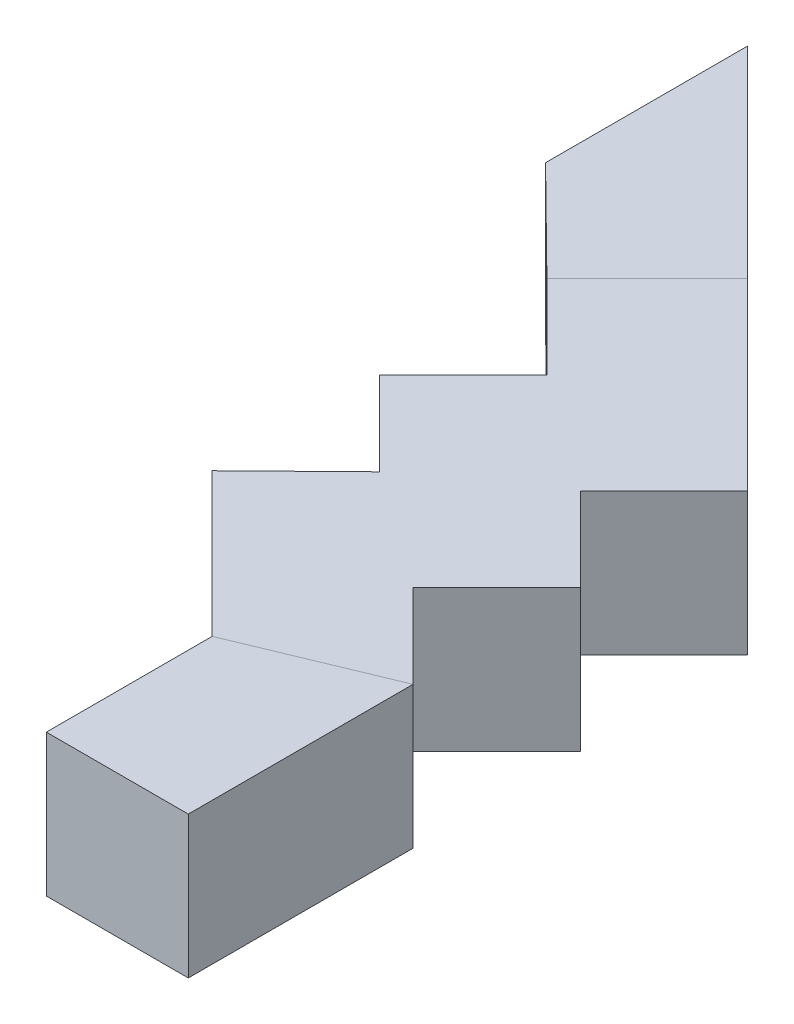
ISO-10303-21;
HEADER;
FILE_DESCRIPTION(('STEP AP214'),'2;1');
FILE_NAME('part.step','',(''),(''),'','','');
FILE_SCHEMA(('AUTOMOTIVE_DESIGN { 1 0 10303 214 1 1 1 1 }'));
ENDSEC;
DATA;
#1=APPLICATION_CONTEXT('core data for automotive mechanical design processes');
#2=APPLICATION_PROTOCOL_DEFINITION('international standard','automotive_design',2000,#1);
#3=PRODUCT_CONTEXT('',#1,'mechanical');
#4=PRODUCT('Part','Part','',(#3));
#5=PRODUCT_RELATED_PRODUCT_CATEGORY('part','',(#4));
#6=PRODUCT_DEFINITION_FORMATION('','',#4);
#7=PRODUCT_DEFINITION_CONTEXT('part definition',#1,'design');
#8=PRODUCT_DEFINITION('design','',#6,#7);
#9=PRODUCT_DEFINITION_SHAPE('','',#8);
#10=(LENGTH_UNIT() NAMED_UNIT(*) SI_UNIT(.MILLI.,.METRE.));
#11=(NAMED_UNIT(*) PLANE_ANGLE_UNIT() SI_UNIT($,.RADIAN.));
#12=(NAMED_UNIT(*) SI_UNIT($,.STERADIAN.) SOLID_ANGLE_UNIT());
#13=UNCERTAINTY_MEASURE_WITH_UNIT(LENGTH_MEASURE(1.E-05),#10,'distance_accuracy_value','');
#14=(GEOMETRIC_REPRESENTATION_CONTEXT(3) GLOBAL_UNCERTAINTY_ASSIGNED_CONTEXT((#13)) GLOBAL_UNIT_ASSIGNED_CONTEXT((#10,
#11,#12)) REPRESENTATION_CONTEXT('',''));
#15=CARTESIAN_POINT('',(0.,0.,0.));
#16=DIRECTION('',(0.,0.,1.));
#17=DIRECTION('',(1.,0.,0.));
#18=AXIS2_PLACEMENT_3D('',#15,#16,#17);
#19=CARTESIAN_POINT('',(0.,0.,0.));
#20=DIRECTION('',(0.,1.,0.));
#21=DIRECTION('',(0.,0.,1.));
#22=AXIS2_PLACEMENT_3D('',#19,#20,#21);
#23=PLANE('',#22);
#24=DIRECTION('',(-1.,0.,0.));
#25=VECTOR('',#24,1.);
#26=CARTESIAN_POINT('',(0.,0.,2800.772749124));
#27=LINE('',#26,#25);
#28=CARTESIAN_POINT('',(-7010.19169348405,0.,2800.772749124));
#29=VERTEX_POINT('',#28);
#30=CARTESIAN_POINT('',(-7610.19169348406,0.,2800.772749124));
#31=VERTEX_POINT('',#30);
#32=EDGE_CURVE('E56',#29,#31,#27,.T.);
#33=ORIENTED_EDGE('',*,*,#32,.F.);
#34=DIRECTION('',(0.,0.,-1.));
#35=VECTOR('',#34,1.);
#36=CARTESIAN_POINT('',(-7010.19169348405,0.,2800.77274912401));
#37=LINE('',#36,#35);
#38=CARTESIAN_POINT('',(-7010.19169348406,0.,1850.77274912401));
#39=VERTEX_POINT('',#38);
#40=EDGE_CURVE('E181',#29,#39,#37,.T.);
#41=ORIENTED_EDGE('',*,*,#40,.T.);
#42=DIRECTION('',(-0.923622513371796,0.,0.383303343049296));
#43=VECTOR('',#42,1.);
#44=CARTESIAN_POINT('',(-374.722918828578,0.,-902.946792358019));
#45=LINE('',#44,#43);
#46=CARTESIAN_POINT('',(-7610.19169348406,0.,2099.77274912401));
#47=VERTEX_POINT('',#46);
#48=EDGE_CURVE('E186',#39,#47,#45,.T.);
#49=ORIENTED_EDGE('',*,*,#48,.T.);
#50=DIRECTION('',(0.,0.,1.));
#51=VECTOR('',#50,1.);
#52=CARTESIAN_POINT('',(-7610.19169348406,0.,3400.77274912401));
#53=LINE('',#52,#51);
#54=EDGE_CURVE('E174',#47,#31,#53,.T.);
#55=ORIENTED_EDGE('',*,*,#54,.T.);
#56=EDGE_LOOP('',(#33,#41,#49,#55));
#57=FACE_BOUND('',#56,.T.);
#58=ADVANCED_FACE('F39',(#57),#23,.T.);
#59=CARTESIAN_POINT('',(0.,-600.,0.));
#60=DIRECTION('',(0.,1.,0.));
#61=DIRECTION('',(0.,0.,1.));
#62=AXIS2_PLACEMENT_3D('',#59,#60,#61);
#63=PLANE('',#62);
#64=DIRECTION('',(0.,0.,-1.));
#65=VECTOR('',#64,1.);
#66=CARTESIAN_POINT('',(-7010.19169348406,-600.,3400.77274912401));
#67=LINE('',#66,#65);
#68=CARTESIAN_POINT('',(-7010.19169348404,-600.,2800.772749124));
#69=VERTEX_POINT('',#68);
#70=CARTESIAN_POINT('',(-7010.19169348406,-600.,1850.77274912401));
#71=VERTEX_POINT('',#70);
#72=EDGE_CURVE('E43',#69,#71,#67,.T.);
#73=ORIENTED_EDGE('',*,*,#72,.F.);
#74=DIRECTION('',(-1.,0.,0.));
#75=VECTOR('',#74,1.);
#76=CARTESIAN_POINT('',(0.,-600.,2800.772749124));
#77=LINE('',#76,#75);
#78=CARTESIAN_POINT('',(-7610.19169348406,-600.,2800.772749124));
#79=VERTEX_POINT('',#78);
#80=EDGE_CURVE('E152',#69,#79,#77,.T.);
#81=ORIENTED_EDGE('',*,*,#80,.T.);
#82=DIRECTION('',(0.,0.,1.));
#83=VECTOR('',#82,1.);
#84=CARTESIAN_POINT('',(-7610.19169348406,-600.,3400.77274912401));
#85=LINE('',#84,#83);
#86=CARTESIAN_POINT('',(-7610.19169348406,-600.,2099.77274912401));
#87=VERTEX_POINT('',#86);
#88=EDGE_CURVE('E163',#87,#79,#85,.T.);
#89=ORIENTED_EDGE('',*,*,#88,.F.);
#90=DIRECTION('',(0.707106781186547,0.,0.707106781186548));
#91=VECTOR('',#90,1.);
#92=CARTESIAN_POINT('',(-7610.19169348406,-600.,2099.77274912401));
#93=LINE('',#92,#91);
#94=CARTESIAN_POINT('',(-8216.47211874121,-600.,1493.49232386685));
#95=VERTEX_POINT('',#94);
#96=EDGE_CURVE('E197',#95,#87,#93,.T.);
#97=ORIENTED_EDGE('',*,*,#96,.F.);
#98=DIRECTION('',(-0.714982573332399,0.,0.699142274384106));
#99=VECTOR('',#98,1.);
#100=CARTESIAN_POINT('',(-8216.47211874121,-600.,1493.49232386685));
#101=LINE('',#100,#99);
#102=CARTESIAN_POINT('',(-7858.71983090791,-600.,1143.66596793746));
#103=VERTEX_POINT('',#102);
#104=EDGE_CURVE('E236',#103,#95,#101,.T.);
#105=ORIENTED_EDGE('',*,*,#104,.F.);
#106=DIRECTION('',(0.707106781186548,0.,0.707106781186547));
#107=VECTOR('',#106,1.);
#108=CARTESIAN_POINT('',(-7858.71983090791,-600.,1143.66596793746));
#109=LINE('',#108,#107);
#110=CARTESIAN_POINT('',(-8212.27322150119,-600.,790.112577344185));
#111=VERTEX_POINT('',#110);
#112=EDGE_CURVE('E239',#111,#103,#109,.T.);
#113=ORIENTED_EDGE('',*,*,#112,.F.);
#114=DIRECTION('',(-0.707106781186546,0.,0.707106781186549));
#115=VECTOR('',#114,1.);
#116=CARTESIAN_POINT('',(-7858.71983090791,-600.,436.55918675091));
#117=LINE('',#116,#115);
#118=CARTESIAN_POINT('',(-7858.71983090791,-600.,436.55918675091));
#119=VERTEX_POINT('',#118);
#120=EDGE_CURVE('E276',#119,#111,#117,.T.);
#121=ORIENTED_EDGE('',*,*,#120,.F.);
#122=DIRECTION('',(0.707106781186548,0.,0.707106781186547));
#123=VECTOR('',#122,1.);
#124=CARTESIAN_POINT('',(-7858.71983090791,-600.,436.55918675091));
#125=LINE('',#124,#123);
#126=CARTESIAN_POINT('',(-8212.27322150119,-600.,83.0057961576385));
#127=VERTEX_POINT('',#126);
#128=EDGE_CURVE('E280',#127,#119,#125,.T.);
#129=ORIENTED_EDGE('',*,*,#128,.F.);
#130=DIRECTION('',(-0.711924819814183,0.,-0.702255687718186));
#131=VECTOR('',#130,1.);
#132=CARTESIAN_POINT('',(-4091.48873489222,-600.,4147.82312383182));
#133=LINE('',#132,#131);
#134=CARTESIAN_POINT('',(-8639.44310705767,-600.,-338.362406502111));
#135=VERTEX_POINT('',#134);
#136=EDGE_CURVE('E305',#127,#135,#133,.T.);
#137=ORIENTED_EDGE('',*,*,#136,.T.);
#138=DIRECTION('',(0.,0.,-1.));
#139=VECTOR('',#138,1.);
#140=CARTESIAN_POINT('',(-8639.44310705767,-600.,0.));
#141=LINE('',#140,#139);
#142=CARTESIAN_POINT('',(-8639.44310705767,-600.,-1192.6922268227));
#143=VERTEX_POINT('',#142);
#144=EDGE_CURVE('E299',#135,#143,#141,.T.);
#145=ORIENTED_EDGE('',*,*,#144,.T.);
#146=DIRECTION('',(-0.707106781186546,0.,-0.707106781186549));
#147=VECTOR('',#146,1.);
#148=CARTESIAN_POINT('',(-7010.19169348406,-600.,436.55918675091));
#149=LINE('',#148,#147);
#150=CARTESIAN_POINT('',(-7788.00915278926,-600.,-341.258272554294));
#151=VERTEX_POINT('',#150);
#152=EDGE_CURVE('E287',#151,#143,#149,.T.);
#153=ORIENTED_EDGE('',*,*,#152,.F.);
#154=CARTESIAN_POINT('',(-7010.19169348406,-600.,436.55918675091));
#155=VERTEX_POINT('',#154);
#156=EDGE_CURVE('E282',#155,#151,#149,.T.);
#157=ORIENTED_EDGE('',*,*,#156,.F.);
#158=DIRECTION('',(0.707106781186548,0.,-0.707106781186547));
#159=VECTOR('',#158,1.);
#160=CARTESIAN_POINT('',(-7363.74508407733,-600.,790.112577344184));
#161=LINE('',#160,#159);
#162=CARTESIAN_POINT('',(-7363.74508407733,-600.,790.112577344184));
#163=VERTEX_POINT('',#162);
#164=EDGE_CURVE('E288',#163,#155,#161,.T.);
#165=ORIENTED_EDGE('',*,*,#164,.F.);
#166=DIRECTION('',(-0.707106781186548,0.,-0.707106781186547));
#167=VECTOR('',#166,1.);
#168=CARTESIAN_POINT('',(-7010.19169348406,-600.,1143.66596793746));
#169=LINE('',#168,#167);
#170=CARTESIAN_POINT('',(-7010.19169348406,-600.,1143.66596793746));
#171=VERTEX_POINT('',#170);
#172=EDGE_CURVE('E291',#171,#163,#169,.T.);
#173=ORIENTED_EDGE('',*,*,#172,.F.);
#174=DIRECTION('',(0.707106781186547,0.,-0.707106781186548));
#175=VECTOR('',#174,1.);
#176=CARTESIAN_POINT('',(-7363.74508407733,-600.,1497.21935853073));
#177=LINE('',#176,#175);
#178=CARTESIAN_POINT('',(-7363.74508407733,-600.,1497.21935853073));
#179=VERTEX_POINT('',#178);
#180=EDGE_CURVE('E211',#179,#171,#177,.T.);
#181=ORIENTED_EDGE('',*,*,#180,.F.);
#182=DIRECTION('',(-0.707106781186548,0.,-0.707106781186547));
#183=VECTOR('',#182,1.);
#184=CARTESIAN_POINT('',(-7010.19169348406,-600.,1850.77274912401));
#185=LINE('',#184,#183);
#186=EDGE_CURVE('E208',#71,#179,#185,.T.);
#187=ORIENTED_EDGE('',*,*,#186,.F.);
#188=EDGE_LOOP('',(#73,#81,#89,#97,#105,#113,#121,#129,#137,#145,#153,#157,#165,#173,#181,#187));
#189=FACE_BOUND('',#188,.T.);
#190=ADVANCED_FACE('F161',(#189),#63,.F.);
#191=CARTESIAN_POINT('',(-7369.52720002991,-600.,77.2236802050576));
#192=DIRECTION('',(0.707106781186546,0.,-0.707106781186549));
#193=DIRECTION('',(-0.707106781186549,0.,-0.707106781186546));
#194=AXIS2_PLACEMENT_3D('',#191,#192,#193);
#195=PLANE('',#194);
#196=ORIENTED_EDGE('',*,*,#156,.T.);
#197=DIRECTION('',(0.,1.,0.));
#198=VECTOR('',#197,1.);
#199=CARTESIAN_POINT('',(-7788.00915278926,-600.,-341.258272554292));
#200=LINE('',#199,#198);
#201=CARTESIAN_POINT('',(-7788.00915278926,0.,-341.258272554292));
#202=VERTEX_POINT('',#201);
#203=EDGE_CURVE('E49',#151,#202,#200,.T.);
#204=ORIENTED_EDGE('',*,*,#203,.T.);
#205=DIRECTION('',(-0.707106781186549,0.,-0.707106781186546));
#206=VECTOR('',#205,1.);
#207=CARTESIAN_POINT('',(-7369.52720002991,0.,77.2236802050576));
#208=LINE('',#207,#206);
#209=CARTESIAN_POINT('',(-7010.19169348406,0.,436.55918675091));
#210=VERTEX_POINT('',#209);
#211=EDGE_CURVE('E256',#210,#202,#208,.T.);
#212=ORIENTED_EDGE('',*,*,#211,.F.);
#213=DIRECTION('',(0.,1.,0.));
#214=VECTOR('',#213,1.);
#215=CARTESIAN_POINT('',(-7010.19169348406,-600.,436.55918675091));
#216=LINE('',#215,#214);
#217=EDGE_CURVE('E227',#155,#210,#216,.T.);
#218=ORIENTED_EDGE('',*,*,#217,.F.);
#219=EDGE_LOOP('',(#196,#204,#212,#218));
#220=FACE_BOUND('',#219,.T.);
#221=ADVANCED_FACE('F332',(#220),#195,.T.);
#222=DIRECTION('',(-0.711924819814183,0.,-0.702255687718186));
#223=VECTOR('',#222,1.);
#224=CARTESIAN_POINT('',(-4091.48873489222,0.,4147.82312383182));
#225=LINE('',#224,#223);
#226=CARTESIAN_POINT('',(-8212.27322150119,0.,83.0057961576385));
#227=VERTEX_POINT('',#226);
#228=CARTESIAN_POINT('',(-8639.44310705767,0.,-338.362406502111));
#229=VERTEX_POINT('',#228);
#230=EDGE_CURVE('E306',#227,#229,#225,.T.);
#231=ORIENTED_EDGE('',*,*,#230,.F.);
#232=DIRECTION('',(0.707106781186545,0.,-0.70710678118655));
#233=VECTOR('',#232,1.);
#234=CARTESIAN_POINT('',(-4064.6337126718,0.,-4064.63371267177));
#235=LINE('',#234,#233);
#236=EDGE_CURVE('E189',#227,#202,#235,.T.);
#237=ORIENTED_EDGE('',*,*,#236,.T.);
#238=CARTESIAN_POINT('',(-8639.44310705767,0.,-1192.6922268227));
#239=VERTEX_POINT('',#238);
#240=EDGE_CURVE('E255',#202,#239,#208,.T.);
#241=ORIENTED_EDGE('',*,*,#240,.T.);
#242=DIRECTION('',(0.,0.,-1.));
#243=VECTOR('',#242,1.);
#244=CARTESIAN_POINT('',(-8639.44310705767,0.,0.));
#245=LINE('',#244,#243);
#246=EDGE_CURVE('E302',#229,#239,#245,.T.);
#247=ORIENTED_EDGE('',*,*,#246,.F.);
#248=EDGE_LOOP('',(#231,#237,#241,#247));
#249=FACE_BOUND('',#248,.T.);
#250=ADVANCED_FACE('F340',(#249),#23,.T.);
#251=ORIENTED_EDGE('',*,*,#48,.F.);
#252=DIRECTION('',(-0.707106781186548,0.,-0.707106781186547));
#253=VECTOR('',#252,1.);
#254=CARTESIAN_POINT('',(-7010.19169348406,0.,1850.77274912401));
#255=LINE('',#254,#253);
#256=CARTESIAN_POINT('',(-7363.74508407733,0.,1497.21935853073));
#257=VERTEX_POINT('',#256);
#258=EDGE_CURVE('E243',#39,#257,#255,.T.);
#259=ORIENTED_EDGE('',*,*,#258,.T.);
#260=DIRECTION('',(0.707106781186547,0.,-0.707106781186548));
#261=VECTOR('',#260,1.);
#262=CARTESIAN_POINT('',(-7363.74508407733,0.,1497.21935853073));
#263=LINE('',#262,#261);
#264=CARTESIAN_POINT('',(-7010.19169348406,0.,1143.66596793746));
#265=VERTEX_POINT('',#264);
#266=EDGE_CURVE('E245',#257,#265,#263,.T.);
#267=ORIENTED_EDGE('',*,*,#266,.T.);
#268=DIRECTION('',(-0.707106781186548,0.,-0.707106781186547));
#269=VECTOR('',#268,1.);
#270=CARTESIAN_POINT('',(-7010.19169348406,0.,1143.66596793746));
#271=LINE('',#270,#269);
#272=CARTESIAN_POINT('',(-7363.74508407733,0.,790.112577344184));
#273=VERTEX_POINT('',#272);
#274=EDGE_CURVE('E249',#265,#273,#271,.T.);
#275=ORIENTED_EDGE('',*,*,#274,.T.);
#276=DIRECTION('',(0.707106781186548,0.,-0.707106781186547));
#277=VECTOR('',#276,1.);
#278=CARTESIAN_POINT('',(-7363.74508407733,0.,790.112577344184));
#279=LINE('',#278,#277);
#280=EDGE_CURVE('E252',#273,#210,#279,.T.);
#281=ORIENTED_EDGE('',*,*,#280,.T.);
#282=ORIENTED_EDGE('',*,*,#211,.T.);
#283=ORIENTED_EDGE('',*,*,#236,.F.);
#284=DIRECTION('',(0.707106781186548,0.,0.707106781186547));
#285=VECTOR('',#284,1.);
#286=CARTESIAN_POINT('',(-7858.71983090791,0.,436.55918675091));
#287=LINE('',#286,#285);
#288=CARTESIAN_POINT('',(-7858.71983090791,0.,436.55918675091));
#289=VERTEX_POINT('',#288);
#290=EDGE_CURVE('E259',#227,#289,#287,.T.);
#291=ORIENTED_EDGE('',*,*,#290,.T.);
#292=DIRECTION('',(-0.707106781186546,0.,0.707106781186549));
#293=VECTOR('',#292,1.);
#294=CARTESIAN_POINT('',(-7858.71983090791,0.,436.55918675091));
#295=LINE('',#294,#293);
#296=CARTESIAN_POINT('',(-8212.27322150119,0.,790.112577344185));
#297=VERTEX_POINT('',#296);
#298=EDGE_CURVE('E262',#289,#297,#295,.T.);
#299=ORIENTED_EDGE('',*,*,#298,.T.);
#300=DIRECTION('',(0.707106781186548,0.,0.707106781186547));
#301=VECTOR('',#300,1.);
#302=CARTESIAN_POINT('',(-7858.71983090791,0.,1143.66596793746));
#303=LINE('',#302,#301);
#304=CARTESIAN_POINT('',(-7858.71983090791,0.,1143.66596793746));
#305=VERTEX_POINT('',#304);
#306=EDGE_CURVE('E213',#297,#305,#303,.T.);
#307=ORIENTED_EDGE('',*,*,#306,.T.);
#308=DIRECTION('',(-0.714982573332399,0.,0.699142274384106));
#309=VECTOR('',#308,1.);
#310=CARTESIAN_POINT('',(-8216.47211874121,0.,1493.49232386685));
#311=LINE('',#310,#309);
#312=CARTESIAN_POINT('',(-8216.47211874121,0.,1493.49232386685));
#313=VERTEX_POINT('',#312);
#314=EDGE_CURVE('E207',#305,#313,#311,.T.);
#315=ORIENTED_EDGE('',*,*,#314,.T.);
#316=DIRECTION('',(0.707106781186547,0.,0.707106781186548));
#317=VECTOR('',#316,1.);
#318=CARTESIAN_POINT('',(-7610.19169348406,0.,2099.77274912401));
#319=LINE('',#318,#317);
#320=EDGE_CURVE('E196',#313,#47,#319,.T.);
#321=ORIENTED_EDGE('',*,*,#320,.T.);
#322=EDGE_LOOP('',(#251,#259,#267,#275,#281,#282,#283,#291,#299,#307,#315,#321));
#323=FACE_BOUND('',#322,.T.);
#324=ADVANCED_FACE('F41',(#323),#23,.T.);
#325=CARTESIAN_POINT('',(-7010.19169348405,-600.,2800.77274912401));
#326=DIRECTION('',(1.,0.,0.));
#327=DIRECTION('',(0.,0.,-1.));
#328=AXIS2_PLACEMENT_3D('',#325,#326,#327);
#329=PLANE('',#328);
#330=DIRECTION('',(0.,1.,0.));
#331=VECTOR('',#330,1.);
#332=CARTESIAN_POINT('',(-7010.19169348405,-600.,2800.772749124));
#333=LINE('',#332,#331);
#334=EDGE_CURVE('E309',#69,#29,#333,.T.);
#335=ORIENTED_EDGE('',*,*,#334,.F.);
#336=ORIENTED_EDGE('',*,*,#72,.T.);
#337=DIRECTION('',(0.,1.,0.));
#338=VECTOR('',#337,1.);
#339=CARTESIAN_POINT('',(-7010.19169348406,-600.,1850.77274912401));
#340=LINE('',#339,#338);
#341=EDGE_CURVE('E170',#71,#39,#340,.T.);
#342=ORIENTED_EDGE('',*,*,#341,.T.);
#343=ORIENTED_EDGE('',*,*,#40,.F.);
#344=EDGE_LOOP('',(#335,#336,#342,#343));
#345=FACE_BOUND('',#344,.T.);
#346=ADVANCED_FACE('F316',(#345),#329,.T.);
#347=CARTESIAN_POINT('',(-7610.19169348406,-600.,3400.77274912401));
#348=DIRECTION('',(-1.,0.,0.));
#349=DIRECTION('',(0.,0.,1.));
#350=AXIS2_PLACEMENT_3D('',#347,#348,#349);
#351=PLANE('',#350);
#352=DIRECTION('',(0.,-1.,0.));
#353=VECTOR('',#352,1.);
#354=CARTESIAN_POINT('',(-7610.19169348406,-600.,2800.772749124));
#355=LINE('',#354,#353);
#356=EDGE_CURVE('E11',#31,#79,#355,.T.);
#357=ORIENTED_EDGE('',*,*,#356,.F.);
#358=ORIENTED_EDGE('',*,*,#54,.F.);
#359=DIRECTION('',(0.,1.,0.));
#360=VECTOR('',#359,1.);
#361=CARTESIAN_POINT('',(-7610.19169348406,-600.,2099.77274912401));
#362=LINE('',#361,#360);
#363=EDGE_CURVE('E169',#87,#47,#362,.T.);
#364=ORIENTED_EDGE('',*,*,#363,.F.);
#365=ORIENTED_EDGE('',*,*,#88,.T.);
#366=EDGE_LOOP('',(#357,#358,#364,#365));
#367=FACE_BOUND('',#366,.T.);
#368=ADVANCED_FACE('F167',(#367),#351,.T.);
#369=CARTESIAN_POINT('',(-7610.19169348406,-600.,2099.77274912401));
#370=DIRECTION('',(-0.707106781186548,0.,0.707106781186547));
#371=DIRECTION('',(0.707106781186547,0.,0.707106781186548));
#372=AXIS2_PLACEMENT_3D('',#369,#370,#371);
#373=PLANE('',#372);
#374=ORIENTED_EDGE('',*,*,#320,.F.);
#375=DIRECTION('',(0.,1.,0.));
#376=VECTOR('',#375,1.);
#377=CARTESIAN_POINT('',(-8216.47211874121,-600.,1493.49232386685));
#378=LINE('',#377,#376);
#379=EDGE_CURVE('E182',#95,#313,#378,.T.);
#380=ORIENTED_EDGE('',*,*,#379,.F.);
#381=ORIENTED_EDGE('',*,*,#96,.T.);
#382=ORIENTED_EDGE('',*,*,#363,.T.);
#383=EDGE_LOOP('',(#374,#380,#381,#382));
#384=FACE_BOUND('',#383,.T.);
#385=ADVANCED_FACE('F194',(#384),#373,.T.);
#386=CARTESIAN_POINT('',(-8216.47211874121,-600.,1493.49232386685));
#387=DIRECTION('',(-0.699142274384106,0.,-0.714982573332399));
#388=DIRECTION('',(-0.714982573332399,0.,0.699142274384106));
#389=AXIS2_PLACEMENT_3D('',#386,#387,#388);
#390=PLANE('',#389);
#391=ORIENTED_EDGE('',*,*,#314,.F.);
#392=DIRECTION('',(0.,1.,0.));
#393=VECTOR('',#392,1.);
#394=CARTESIAN_POINT('',(-7858.71983090791,-600.,1143.66596793746));
#395=LINE('',#394,#393);
#396=EDGE_CURVE('E218',#103,#305,#395,.T.);
#397=ORIENTED_EDGE('',*,*,#396,.F.);
#398=ORIENTED_EDGE('',*,*,#104,.T.);
#399=ORIENTED_EDGE('',*,*,#379,.T.);
#400=EDGE_LOOP('',(#391,#397,#398,#399));
#401=FACE_BOUND('',#400,.T.);
#402=ADVANCED_FACE('F272',(#401),#390,.T.);
#403=CARTESIAN_POINT('',(-7858.71983090791,-600.,1143.66596793746));
#404=DIRECTION('',(-0.707106781186547,0.,0.707106781186548));
#405=DIRECTION('',(0.707106781186548,0.,0.707106781186547));
#406=AXIS2_PLACEMENT_3D('',#403,#404,#405);
#407=PLANE('',#406);
#408=ORIENTED_EDGE('',*,*,#306,.F.);
#409=DIRECTION('',(0.,1.,0.));
#410=VECTOR('',#409,1.);
#411=CARTESIAN_POINT('',(-8212.27322150119,-600.,790.112577344185));
#412=LINE('',#411,#410);
#413=EDGE_CURVE('E220',#111,#297,#412,.T.);
#414=ORIENTED_EDGE('',*,*,#413,.F.);
#415=ORIENTED_EDGE('',*,*,#112,.T.);
#416=ORIENTED_EDGE('',*,*,#396,.T.);
#417=EDGE_LOOP('',(#408,#414,#415,#416));
#418=FACE_BOUND('',#417,.T.);
#419=ADVANCED_FACE('F267',(#418),#407,.T.);
#420=CARTESIAN_POINT('',(-7858.71983090791,-600.,436.55918675091));
#421=DIRECTION('',(-0.707106781186549,0.,-0.707106781186546));
#422=DIRECTION('',(-0.707106781186546,0.,0.707106781186549));
#423=AXIS2_PLACEMENT_3D('',#420,#421,#422);
#424=PLANE('',#423);
#425=ORIENTED_EDGE('',*,*,#298,.F.);
#426=DIRECTION('',(0.,1.,0.));
#427=VECTOR('',#426,1.);
#428=CARTESIAN_POINT('',(-7858.71983090791,-600.,436.55918675091));
#429=LINE('',#428,#427);
#430=EDGE_CURVE('E222',#119,#289,#429,.T.);
#431=ORIENTED_EDGE('',*,*,#430,.F.);
#432=ORIENTED_EDGE('',*,*,#120,.T.);
#433=ORIENTED_EDGE('',*,*,#413,.T.);
#434=EDGE_LOOP('',(#425,#431,#432,#433));
#435=FACE_BOUND('',#434,.T.);
#436=ADVANCED_FACE('F279',(#435),#424,.T.);
#437=CARTESIAN_POINT('',(-7858.71983090791,-600.,436.55918675091));
#438=DIRECTION('',(-0.707106781186547,0.,0.707106781186548));
#439=DIRECTION('',(0.707106781186548,0.,0.707106781186547));
#440=AXIS2_PLACEMENT_3D('',#437,#438,#439);
#441=PLANE('',#440);
#442=ORIENTED_EDGE('',*,*,#290,.F.);
#443=DIRECTION('',(0.,1.,0.));
#444=VECTOR('',#443,1.);
#445=CARTESIAN_POINT('',(-8212.27322150119,-600.,83.0057961576376));
#446=LINE('',#445,#444);
#447=EDGE_CURVE('E224',#127,#227,#446,.T.);
#448=ORIENTED_EDGE('',*,*,#447,.F.);
#449=ORIENTED_EDGE('',*,*,#128,.T.);
#450=ORIENTED_EDGE('',*,*,#430,.T.);
#451=EDGE_LOOP('',(#442,#448,#449,#450));
#452=FACE_BOUND('',#451,.T.);
#453=ADVANCED_FACE('F346',(#452),#441,.T.);
#454=ORIENTED_EDGE('',*,*,#203,.F.);
#455=ORIENTED_EDGE('',*,*,#152,.T.);
#456=DIRECTION('',(0.,1.,0.));
#457=VECTOR('',#456,1.);
#458=CARTESIAN_POINT('',(-8639.44310705767,-600.,-1192.6922268227));
#459=LINE('',#458,#457);
#460=EDGE_CURVE('E296',#143,#239,#459,.T.);
#461=ORIENTED_EDGE('',*,*,#460,.T.);
#462=ORIENTED_EDGE('',*,*,#240,.F.);
#463=EDGE_LOOP('',(#454,#455,#461,#462));
#464=FACE_BOUND('',#463,.T.);
#465=ADVANCED_FACE('F334',(#464),#195,.T.);
#466=CARTESIAN_POINT('',(-7363.74508407733,-600.,790.112577344184));
#467=DIRECTION('',(0.707106781186547,0.,0.707106781186548));
#468=DIRECTION('',(0.707106781186548,0.,-0.707106781186547));
#469=AXIS2_PLACEMENT_3D('',#466,#467,#468);
#470=PLANE('',#469);
#471=ORIENTED_EDGE('',*,*,#280,.F.);
#472=DIRECTION('',(0.,1.,0.));
#473=VECTOR('',#472,1.);
#474=CARTESIAN_POINT('',(-7363.74508407733,-600.,790.112577344184));
#475=LINE('',#474,#473);
#476=EDGE_CURVE('E230',#163,#273,#475,.T.);
#477=ORIENTED_EDGE('',*,*,#476,.F.);
#478=ORIENTED_EDGE('',*,*,#164,.T.);
#479=ORIENTED_EDGE('',*,*,#217,.T.);
#480=EDGE_LOOP('',(#471,#477,#478,#479));
#481=FACE_BOUND('',#480,.T.);
#482=ADVANCED_FACE('F329',(#481),#470,.T.);
#483=CARTESIAN_POINT('',(-7010.19169348406,-600.,1143.66596793746));
#484=DIRECTION('',(0.707106781186547,0.,-0.707106781186548));
#485=DIRECTION('',(-0.707106781186548,0.,-0.707106781186547));
#486=AXIS2_PLACEMENT_3D('',#483,#484,#485);
#487=PLANE('',#486);
#488=ORIENTED_EDGE('',*,*,#274,.F.);
#489=DIRECTION('',(0.,1.,0.));
#490=VECTOR('',#489,1.);
#491=CARTESIAN_POINT('',(-7010.19169348406,-600.,1143.66596793746));
#492=LINE('',#491,#490);
#493=EDGE_CURVE('E232',#171,#265,#492,.T.);
#494=ORIENTED_EDGE('',*,*,#493,.F.);
#495=ORIENTED_EDGE('',*,*,#172,.T.);
#496=ORIENTED_EDGE('',*,*,#476,.T.);
#497=EDGE_LOOP('',(#488,#494,#495,#496));
#498=FACE_BOUND('',#497,.T.);
#499=ADVANCED_FACE('F327',(#498),#487,.T.);
#500=CARTESIAN_POINT('',(-7363.74508407733,-600.,1497.21935853073));
#501=DIRECTION('',(0.707106781186548,0.,0.707106781186547));
#502=DIRECTION('',(0.707106781186547,0.,-0.707106781186548));
#503=AXIS2_PLACEMENT_3D('',#500,#501,#502);
#504=PLANE('',#503);
#505=ORIENTED_EDGE('',*,*,#266,.F.);
#506=DIRECTION('',(0.,1.,0.));
#507=VECTOR('',#506,1.);
#508=CARTESIAN_POINT('',(-7363.74508407733,-600.,1497.21935853073));
#509=LINE('',#508,#507);
#510=EDGE_CURVE('E233',#179,#257,#509,.T.);
#511=ORIENTED_EDGE('',*,*,#510,.F.);
#512=ORIENTED_EDGE('',*,*,#180,.T.);
#513=ORIENTED_EDGE('',*,*,#493,.T.);
#514=EDGE_LOOP('',(#505,#511,#512,#513));
#515=FACE_BOUND('',#514,.T.);
#516=ADVANCED_FACE('F323',(#515),#504,.T.);
#517=CARTESIAN_POINT('',(-7010.19169348406,-600.,1850.77274912401));
#518=DIRECTION('',(0.707106781186547,0.,-0.707106781186548));
#519=DIRECTION('',(-0.707106781186548,0.,-0.707106781186547));
#520=AXIS2_PLACEMENT_3D('',#517,#518,#519);
#521=PLANE('',#520);
#522=ORIENTED_EDGE('',*,*,#258,.F.);
#523=ORIENTED_EDGE('',*,*,#341,.F.);
#524=ORIENTED_EDGE('',*,*,#186,.T.);
#525=ORIENTED_EDGE('',*,*,#510,.T.);
#526=EDGE_LOOP('',(#522,#523,#524,#525));
#527=FACE_BOUND('',#526,.T.);
#528=ADVANCED_FACE('F318',(#527),#521,.T.);
#529=CARTESIAN_POINT('',(-4091.48873489222,-600.,4147.82312383182));
#530=DIRECTION('',(0.702255687718186,0.,-0.711924819814184));
#531=DIRECTION('',(-0.711924819814184,0.,-0.702255687718186));
#532=AXIS2_PLACEMENT_3D('',#529,#530,#531);
#533=PLANE('',#532);
#534=ORIENTED_EDGE('',*,*,#230,.T.);
#535=DIRECTION('',(0.,1.,0.));
#536=VECTOR('',#535,1.);
#537=CARTESIAN_POINT('',(-8639.44310705767,-600.,-338.362406502111));
#538=LINE('',#537,#536);
#539=EDGE_CURVE('E246',#135,#229,#538,.T.);
#540=ORIENTED_EDGE('',*,*,#539,.F.);
#541=ORIENTED_EDGE('',*,*,#136,.F.);
#542=ORIENTED_EDGE('',*,*,#447,.T.);
#543=EDGE_LOOP('',(#534,#540,#541,#542));
#544=FACE_BOUND('',#543,.T.);
#545=ADVANCED_FACE('F344',(#544),#533,.F.);
#546=CARTESIAN_POINT('',(-8639.44310705767,-600.,0.));
#547=DIRECTION('',(1.,0.,0.));
#548=DIRECTION('',(0.,0.,-1.));
#549=AXIS2_PLACEMENT_3D('',#546,#547,#548);
#550=PLANE('',#549);
#551=ORIENTED_EDGE('',*,*,#246,.T.);
#552=ORIENTED_EDGE('',*,*,#460,.F.);
#553=ORIENTED_EDGE('',*,*,#144,.F.);
#554=ORIENTED_EDGE('',*,*,#539,.T.);
#555=EDGE_LOOP('',(#551,#552,#553,#554));
#556=FACE_BOUND('',#555,.T.);
#557=ADVANCED_FACE('F336',(#556),#550,.F.);
#558=CARTESIAN_POINT('',(0.,0.,2800.772749124));
#559=DIRECTION('',(0.,0.,-1.));
#560=DIRECTION('',(-1.,0.,0.));
#561=AXIS2_PLACEMENT_3D('',#558,#559,#560);
#562=PLANE('',#561);
#563=ORIENTED_EDGE('',*,*,#334,.T.);
#564=ORIENTED_EDGE('',*,*,#32,.T.);
#565=ORIENTED_EDGE('',*,*,#356,.T.);
#566=ORIENTED_EDGE('',*,*,#80,.F.);
#567=EDGE_LOOP('',(#563,#564,#565,#566));
#568=FACE_BOUND('',#567,.T.);
#569=ADVANCED_FACE('F151',(#568),#562,.F.);
#570=CLOSED_SHELL('',(#58,#190,#221,#250,#324,#346,#368,#385,#402,#419,#436,#453,#465,#482,#499,
#516,#528,#545,#557,#569));
#571=MANIFOLD_SOLID_BREP('B2',#570);
#572=ADVANCED_BREP_SHAPE_REPRESENTATION('',(#18,#571),#14);
#573=SHAPE_DEFINITION_REPRESENTATION(#9,#572);
ENDSEC;
END-ISO-10303-21;
